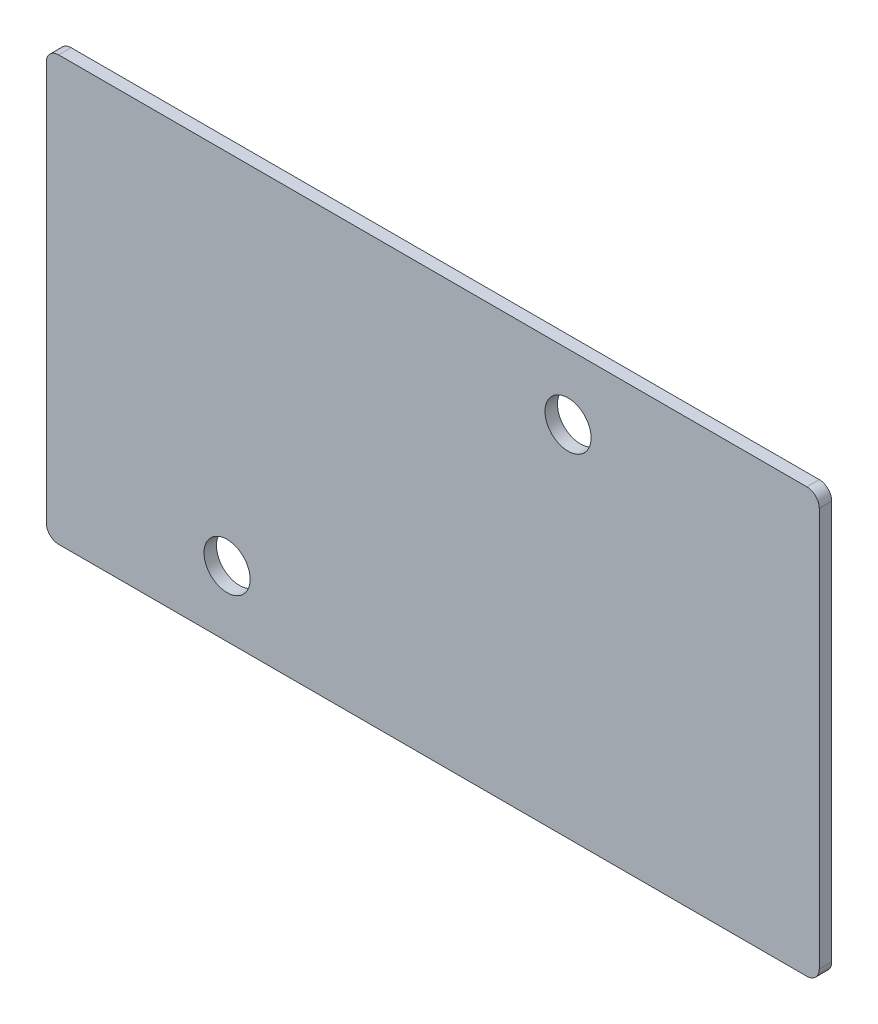
ISO-10303-21;
HEADER;
FILE_DESCRIPTION(('STEP AP214'),'2;1');
FILE_NAME('part.step','',(''),(''),'','','');
FILE_SCHEMA(('AUTOMOTIVE_DESIGN { 1 0 10303 214 1 1 1 1 }'));
ENDSEC;
DATA;
#1=APPLICATION_CONTEXT('core data for automotive mechanical design processes');
#2=APPLICATION_PROTOCOL_DEFINITION('international standard','automotive_design',2000,#1);
#3=PRODUCT_CONTEXT('',#1,'mechanical');
#4=PRODUCT('Part','Part','',(#3));
#5=PRODUCT_RELATED_PRODUCT_CATEGORY('part','',(#4));
#6=PRODUCT_DEFINITION_FORMATION('','',#4);
#7=PRODUCT_DEFINITION_CONTEXT('part definition',#1,'design');
#8=PRODUCT_DEFINITION('design','',#6,#7);
#9=PRODUCT_DEFINITION_SHAPE('','',#8);
#10=(LENGTH_UNIT() NAMED_UNIT(*) SI_UNIT(.MILLI.,.METRE.));
#11=(NAMED_UNIT(*) PLANE_ANGLE_UNIT() SI_UNIT($,.RADIAN.));
#12=(NAMED_UNIT(*) SI_UNIT($,.STERADIAN.) SOLID_ANGLE_UNIT());
#13=UNCERTAINTY_MEASURE_WITH_UNIT(LENGTH_MEASURE(1.E-05),#10,'distance_accuracy_value','');
#14=(GEOMETRIC_REPRESENTATION_CONTEXT(3) GLOBAL_UNCERTAINTY_ASSIGNED_CONTEXT((#13)) GLOBAL_UNIT_ASSIGNED_CONTEXT((#10,
#11,#12)) REPRESENTATION_CONTEXT('',''));
#15=CARTESIAN_POINT('',(0.,0.,0.));
#16=DIRECTION('',(0.,0.,1.));
#17=DIRECTION('',(1.,0.,0.));
#18=AXIS2_PLACEMENT_3D('',#15,#16,#17);
#19=CARTESIAN_POINT('',(-5.,-1.25,1.));
#20=DIRECTION('',(0.,0.,1.));
#21=DIRECTION('',(1.,0.,0.));
#22=AXIS2_PLACEMENT_3D('',#19,#20,#21);
#23=PLANE('',#22);
#24=CARTESIAN_POINT('',(35.85,26.5,1.));
#25=DIRECTION('',(0.,0.,1.));
#26=DIRECTION('',(1.,0.,0.));
#27=AXIS2_PLACEMENT_3D('',#24,#25,#26);
#28=CIRCLE('',#27,1.85);
#29=CARTESIAN_POINT('',(37.7,26.5,1.));
#30=VERTEX_POINT('',#29);
#31=EDGE_CURVE('E135',#30,#30,#28,.T.);
#32=ORIENTED_EDGE('',*,*,#31,.F.);
#33=EDGE_LOOP('',(#32));
#34=FACE_BOUND('',#33,.T.);
#35=CARTESIAN_POINT('',(-5.,-1.25,1.));
#36=DIRECTION('',(0.,0.,1.));
#37=DIRECTION('',(1.,0.,0.));
#38=AXIS2_PLACEMENT_3D('',#35,#36,#37);
#39=CIRCLE('',#38,1.);
#40=CARTESIAN_POINT('',(-6.,-1.25,1.));
#41=VERTEX_POINT('',#40);
#42=CARTESIAN_POINT('',(-5.,-2.25,1.));
#43=VERTEX_POINT('',#42);
#44=EDGE_CURVE('E146',#41,#43,#39,.T.);
#45=ORIENTED_EDGE('',*,*,#44,.T.);
#46=DIRECTION('',(1.,0.,0.));
#47=VECTOR('',#46,1.);
#48=CARTESIAN_POINT('',(-5.,-2.25,1.));
#49=LINE('',#48,#47);
#50=CARTESIAN_POINT('',(55.,-2.25,1.));
#51=VERTEX_POINT('',#50);
#52=EDGE_CURVE('E94',#43,#51,#49,.T.);
#53=ORIENTED_EDGE('',*,*,#52,.T.);
#54=CARTESIAN_POINT('',(55.,-1.25,1.));
#55=DIRECTION('',(0.,0.,1.));
#56=DIRECTION('',(1.,0.,0.));
#57=AXIS2_PLACEMENT_3D('',#54,#55,#56);
#58=CIRCLE('',#57,1.);
#59=CARTESIAN_POINT('',(56.,-1.25,1.));
#60=VERTEX_POINT('',#59);
#61=EDGE_CURVE('E161',#51,#60,#58,.T.);
#62=ORIENTED_EDGE('',*,*,#61,.T.);
#63=DIRECTION('',(0.,1.,0.));
#64=VECTOR('',#63,1.);
#65=CARTESIAN_POINT('',(56.,-1.25,1.));
#66=LINE('',#65,#64);
#67=CARTESIAN_POINT('',(56.,30.75,1.));
#68=VERTEX_POINT('',#67);
#69=EDGE_CURVE('E174',#60,#68,#66,.T.);
#70=ORIENTED_EDGE('',*,*,#69,.T.);
#71=CARTESIAN_POINT('',(55.,30.75,1.));
#72=DIRECTION('',(0.,0.,1.));
#73=DIRECTION('',(1.,0.,0.));
#74=AXIS2_PLACEMENT_3D('',#71,#72,#73);
#75=CIRCLE('',#74,1.);
#76=CARTESIAN_POINT('',(55.,31.75,1.));
#77=VERTEX_POINT('',#76);
#78=EDGE_CURVE('E113',#68,#77,#75,.T.);
#79=ORIENTED_EDGE('',*,*,#78,.T.);
#80=DIRECTION('',(-1.,0.,0.));
#81=VECTOR('',#80,1.);
#82=CARTESIAN_POINT('',(-5.,31.75,1.));
#83=LINE('',#82,#81);
#84=CARTESIAN_POINT('',(-5.,31.75,1.));
#85=VERTEX_POINT('',#84);
#86=EDGE_CURVE('E107',#77,#85,#83,.T.);
#87=ORIENTED_EDGE('',*,*,#86,.T.);
#88=CARTESIAN_POINT('',(-5.,30.75,1.));
#89=DIRECTION('',(0.,0.,1.));
#90=DIRECTION('',(1.,0.,0.));
#91=AXIS2_PLACEMENT_3D('',#88,#89,#90);
#92=CIRCLE('',#91,1.);
#93=CARTESIAN_POINT('',(-6.,30.75,1.));
#94=VERTEX_POINT('',#93);
#95=EDGE_CURVE('E111',#85,#94,#92,.T.);
#96=ORIENTED_EDGE('',*,*,#95,.T.);
#97=DIRECTION('',(0.,-1.,0.));
#98=VECTOR('',#97,1.);
#99=CARTESIAN_POINT('',(-6.,-1.25,1.));
#100=LINE('',#99,#98);
#101=EDGE_CURVE('E51',#94,#41,#100,.T.);
#102=ORIENTED_EDGE('',*,*,#101,.T.);
#103=EDGE_LOOP('',(#45,#53,#62,#70,#79,#87,#96,#102));
#104=FACE_BOUND('',#103,.T.);
#105=CARTESIAN_POINT('',(8.5,3.,1.));
#106=DIRECTION('',(0.,0.,1.));
#107=DIRECTION('',(1.,0.,0.));
#108=AXIS2_PLACEMENT_3D('',#105,#106,#107);
#109=CIRCLE('',#108,1.85);
#110=CARTESIAN_POINT('',(10.35,3.,1.));
#111=VERTEX_POINT('',#110);
#112=EDGE_CURVE('E183',#111,#111,#109,.T.);
#113=ORIENTED_EDGE('',*,*,#112,.F.);
#114=EDGE_LOOP('',(#113));
#115=FACE_BOUND('',#114,.T.);
#116=ADVANCED_FACE('F34',(#34,#104,#115),#23,.T.);
#117=CARTESIAN_POINT('',(-5.,-1.25,0.));
#118=DIRECTION('',(0.,0.,1.));
#119=DIRECTION('',(1.,0.,0.));
#120=AXIS2_PLACEMENT_3D('',#117,#118,#119);
#121=PLANE('',#120);
#122=CARTESIAN_POINT('',(35.85,26.5,0.));
#123=DIRECTION('',(0.,0.,1.));
#124=DIRECTION('',(1.,0.,0.));
#125=AXIS2_PLACEMENT_3D('',#122,#123,#124);
#126=CIRCLE('',#125,1.85);
#127=CARTESIAN_POINT('',(37.7,26.5,0.));
#128=VERTEX_POINT('',#127);
#129=EDGE_CURVE('E180',#128,#128,#126,.T.);
#130=ORIENTED_EDGE('',*,*,#129,.T.);
#131=EDGE_LOOP('',(#130));
#132=FACE_BOUND('',#131,.T.);
#133=CARTESIAN_POINT('',(-5.,-1.25,0.));
#134=DIRECTION('',(0.,0.,1.));
#135=DIRECTION('',(1.,0.,0.));
#136=AXIS2_PLACEMENT_3D('',#133,#134,#135);
#137=CIRCLE('',#136,1.);
#138=CARTESIAN_POINT('',(-6.,-1.25,0.));
#139=VERTEX_POINT('',#138);
#140=CARTESIAN_POINT('',(-5.,-2.25,0.));
#141=VERTEX_POINT('',#140);
#142=EDGE_CURVE('E131',#139,#141,#137,.T.);
#143=ORIENTED_EDGE('',*,*,#142,.F.);
#144=DIRECTION('',(0.,-1.,0.));
#145=VECTOR('',#144,1.);
#146=CARTESIAN_POINT('',(-6.,-1.25,0.));
#147=LINE('',#146,#145);
#148=CARTESIAN_POINT('',(-6.,30.75,0.));
#149=VERTEX_POINT('',#148);
#150=EDGE_CURVE('E86',#149,#139,#147,.T.);
#151=ORIENTED_EDGE('',*,*,#150,.F.);
#152=CARTESIAN_POINT('',(-5.,30.75,0.));
#153=DIRECTION('',(0.,0.,1.));
#154=DIRECTION('',(1.,0.,0.));
#155=AXIS2_PLACEMENT_3D('',#152,#153,#154);
#156=CIRCLE('',#155,1.);
#157=CARTESIAN_POINT('',(-5.,31.75,0.));
#158=VERTEX_POINT('',#157);
#159=EDGE_CURVE('E80',#158,#149,#156,.T.);
#160=ORIENTED_EDGE('',*,*,#159,.F.);
#161=DIRECTION('',(-1.,0.,0.));
#162=VECTOR('',#161,1.);
#163=CARTESIAN_POINT('',(-5.,31.75,0.));
#164=LINE('',#163,#162);
#165=CARTESIAN_POINT('',(55.,31.75,0.));
#166=VERTEX_POINT('',#165);
#167=EDGE_CURVE('E121',#166,#158,#164,.T.);
#168=ORIENTED_EDGE('',*,*,#167,.F.);
#169=CARTESIAN_POINT('',(55.,30.75,0.));
#170=DIRECTION('',(0.,0.,1.));
#171=DIRECTION('',(1.,0.,0.));
#172=AXIS2_PLACEMENT_3D('',#169,#170,#171);
#173=CIRCLE('',#172,1.);
#174=CARTESIAN_POINT('',(56.,30.75,0.));
#175=VERTEX_POINT('',#174);
#176=EDGE_CURVE('E141',#175,#166,#173,.T.);
#177=ORIENTED_EDGE('',*,*,#176,.F.);
#178=DIRECTION('',(0.,1.,0.));
#179=VECTOR('',#178,1.);
#180=CARTESIAN_POINT('',(56.,-1.25,0.));
#181=LINE('',#180,#179);
#182=CARTESIAN_POINT('',(56.,-1.25,0.));
#183=VERTEX_POINT('',#182);
#184=EDGE_CURVE('E139',#183,#175,#181,.T.);
#185=ORIENTED_EDGE('',*,*,#184,.F.);
#186=CARTESIAN_POINT('',(55.,-1.25,0.));
#187=DIRECTION('',(0.,0.,1.));
#188=DIRECTION('',(1.,0.,0.));
#189=AXIS2_PLACEMENT_3D('',#186,#187,#188);
#190=CIRCLE('',#189,1.);
#191=CARTESIAN_POINT('',(55.,-2.25,0.));
#192=VERTEX_POINT('',#191);
#193=EDGE_CURVE('E137',#192,#183,#190,.T.);
#194=ORIENTED_EDGE('',*,*,#193,.F.);
#195=DIRECTION('',(1.,0.,0.));
#196=VECTOR('',#195,1.);
#197=CARTESIAN_POINT('',(-5.,-2.25,0.));
#198=LINE('',#197,#196);
#199=EDGE_CURVE('E134',#141,#192,#198,.T.);
#200=ORIENTED_EDGE('',*,*,#199,.F.);
#201=EDGE_LOOP('',(#143,#151,#160,#168,#177,#185,#194,#200));
#202=FACE_BOUND('',#201,.T.);
#203=CARTESIAN_POINT('',(8.5,3.,0.));
#204=DIRECTION('',(0.,0.,1.));
#205=DIRECTION('',(1.,0.,0.));
#206=AXIS2_PLACEMENT_3D('',#203,#204,#205);
#207=CIRCLE('',#206,1.85);
#208=CARTESIAN_POINT('',(10.35,3.,0.));
#209=VERTEX_POINT('',#208);
#210=EDGE_CURVE('E186',#209,#209,#207,.T.);
#211=ORIENTED_EDGE('',*,*,#210,.T.);
#212=EDGE_LOOP('',(#211));
#213=FACE_BOUND('',#212,.T.);
#214=ADVANCED_FACE('F165',(#132,#202,#213),#121,.F.);
#215=CARTESIAN_POINT('',(-5.,-1.25,1.));
#216=DIRECTION('',(0.,0.,-1.));
#217=DIRECTION('',(-1.,0.,0.));
#218=AXIS2_PLACEMENT_3D('',#215,#216,#217);
#219=CYLINDRICAL_SURFACE('',#218,1.);
#220=ORIENTED_EDGE('',*,*,#142,.T.);
#221=DIRECTION('',(0.,0.,-1.));
#222=VECTOR('',#221,1.);
#223=CARTESIAN_POINT('',(-5.,-2.25,1.));
#224=LINE('',#223,#222);
#225=EDGE_CURVE('E11',#43,#141,#224,.T.);
#226=ORIENTED_EDGE('',*,*,#225,.F.);
#227=ORIENTED_EDGE('',*,*,#44,.F.);
#228=DIRECTION('',(0.,0.,-1.));
#229=VECTOR('',#228,1.);
#230=CARTESIAN_POINT('',(-6.,-1.25,1.));
#231=LINE('',#230,#229);
#232=EDGE_CURVE('E127',#41,#139,#231,.T.);
#233=ORIENTED_EDGE('',*,*,#232,.T.);
#234=EDGE_LOOP('',(#220,#226,#227,#233));
#235=FACE_BOUND('',#234,.T.);
#236=ADVANCED_FACE('F36',(#235),#219,.T.);
#237=CARTESIAN_POINT('',(-5.,-2.25,1.));
#238=DIRECTION('',(0.,1.,0.));
#239=DIRECTION('',(-1.,0.,0.));
#240=AXIS2_PLACEMENT_3D('',#237,#238,#239);
#241=PLANE('',#240);
#242=ORIENTED_EDGE('',*,*,#199,.T.);
#243=DIRECTION('',(0.,0.,-1.));
#244=VECTOR('',#243,1.);
#245=CARTESIAN_POINT('',(55.,-2.25,1.));
#246=LINE('',#245,#244);
#247=EDGE_CURVE('E43',#51,#192,#246,.T.);
#248=ORIENTED_EDGE('',*,*,#247,.F.);
#249=ORIENTED_EDGE('',*,*,#52,.F.);
#250=ORIENTED_EDGE('',*,*,#225,.T.);
#251=EDGE_LOOP('',(#242,#248,#249,#250));
#252=FACE_BOUND('',#251,.T.);
#253=ADVANCED_FACE('F219',(#252),#241,.F.);
#254=CARTESIAN_POINT('',(55.,-1.25,1.));
#255=DIRECTION('',(0.,0.,-1.));
#256=DIRECTION('',(-1.,0.,0.));
#257=AXIS2_PLACEMENT_3D('',#254,#255,#256);
#258=CYLINDRICAL_SURFACE('',#257,1.);
#259=ORIENTED_EDGE('',*,*,#193,.T.);
#260=DIRECTION('',(0.,0.,-1.));
#261=VECTOR('',#260,1.);
#262=CARTESIAN_POINT('',(56.,-1.25,1.));
#263=LINE('',#262,#261);
#264=EDGE_CURVE('E153',#60,#183,#263,.T.);
#265=ORIENTED_EDGE('',*,*,#264,.F.);
#266=ORIENTED_EDGE('',*,*,#61,.F.);
#267=ORIENTED_EDGE('',*,*,#247,.T.);
#268=EDGE_LOOP('',(#259,#265,#266,#267));
#269=FACE_BOUND('',#268,.T.);
#270=ADVANCED_FACE('F159',(#269),#258,.T.);
#271=CARTESIAN_POINT('',(56.,-1.25,1.));
#272=DIRECTION('',(-1.,0.,0.));
#273=DIRECTION('',(0.,0.,1.));
#274=AXIS2_PLACEMENT_3D('',#271,#272,#273);
#275=PLANE('',#274);
#276=ORIENTED_EDGE('',*,*,#184,.T.);
#277=DIRECTION('',(0.,0.,-1.));
#278=VECTOR('',#277,1.);
#279=CARTESIAN_POINT('',(56.,30.75,1.));
#280=LINE('',#279,#278);
#281=EDGE_CURVE('E150',#68,#175,#280,.T.);
#282=ORIENTED_EDGE('',*,*,#281,.F.);
#283=ORIENTED_EDGE('',*,*,#69,.F.);
#284=ORIENTED_EDGE('',*,*,#264,.T.);
#285=EDGE_LOOP('',(#276,#282,#283,#284));
#286=FACE_BOUND('',#285,.T.);
#287=ADVANCED_FACE('F170',(#286),#275,.F.);
#288=CARTESIAN_POINT('',(55.,30.75,1.));
#289=DIRECTION('',(0.,0.,-1.));
#290=DIRECTION('',(-1.,0.,0.));
#291=AXIS2_PLACEMENT_3D('',#288,#289,#290);
#292=CYLINDRICAL_SURFACE('',#291,1.);
#293=ORIENTED_EDGE('',*,*,#176,.T.);
#294=DIRECTION('',(0.,0.,-1.));
#295=VECTOR('',#294,1.);
#296=CARTESIAN_POINT('',(55.,31.75,1.));
#297=LINE('',#296,#295);
#298=EDGE_CURVE('E122',#77,#166,#297,.T.);
#299=ORIENTED_EDGE('',*,*,#298,.F.);
#300=ORIENTED_EDGE('',*,*,#78,.F.);
#301=ORIENTED_EDGE('',*,*,#281,.T.);
#302=EDGE_LOOP('',(#293,#299,#300,#301));
#303=FACE_BOUND('',#302,.T.);
#304=ADVANCED_FACE('F173',(#303),#292,.T.);
#305=CARTESIAN_POINT('',(-5.,31.75,1.));
#306=DIRECTION('',(0.,-1.,0.));
#307=DIRECTION('',(0.,0.,-1.));
#308=AXIS2_PLACEMENT_3D('',#305,#306,#307);
#309=PLANE('',#308);
#310=ORIENTED_EDGE('',*,*,#167,.T.);
#311=DIRECTION('',(0.,0.,-1.));
#312=VECTOR('',#311,1.);
#313=CARTESIAN_POINT('',(-5.,31.75,1.));
#314=LINE('',#313,#312);
#315=EDGE_CURVE('E118',#85,#158,#314,.T.);
#316=ORIENTED_EDGE('',*,*,#315,.F.);
#317=ORIENTED_EDGE('',*,*,#86,.F.);
#318=ORIENTED_EDGE('',*,*,#298,.T.);
#319=EDGE_LOOP('',(#310,#316,#317,#318));
#320=FACE_BOUND('',#319,.T.);
#321=ADVANCED_FACE('F119',(#320),#309,.F.);
#322=CARTESIAN_POINT('',(-5.,30.75,1.));
#323=DIRECTION('',(0.,0.,-1.));
#324=DIRECTION('',(-1.,0.,0.));
#325=AXIS2_PLACEMENT_3D('',#322,#323,#324);
#326=CYLINDRICAL_SURFACE('',#325,1.);
#327=ORIENTED_EDGE('',*,*,#159,.T.);
#328=DIRECTION('',(0.,0.,-1.));
#329=VECTOR('',#328,1.);
#330=CARTESIAN_POINT('',(-6.,30.75,1.));
#331=LINE('',#330,#329);
#332=EDGE_CURVE('E123',#94,#149,#331,.T.);
#333=ORIENTED_EDGE('',*,*,#332,.F.);
#334=ORIENTED_EDGE('',*,*,#95,.F.);
#335=ORIENTED_EDGE('',*,*,#315,.T.);
#336=EDGE_LOOP('',(#327,#333,#334,#335));
#337=FACE_BOUND('',#336,.T.);
#338=ADVANCED_FACE('F125',(#337),#326,.T.);
#339=CARTESIAN_POINT('',(-6.,-1.25,1.));
#340=DIRECTION('',(1.,0.,0.));
#341=DIRECTION('',(0.,0.,-1.));
#342=AXIS2_PLACEMENT_3D('',#339,#340,#341);
#343=PLANE('',#342);
#344=ORIENTED_EDGE('',*,*,#150,.T.);
#345=ORIENTED_EDGE('',*,*,#232,.F.);
#346=ORIENTED_EDGE('',*,*,#101,.F.);
#347=ORIENTED_EDGE('',*,*,#332,.T.);
#348=EDGE_LOOP('',(#344,#345,#346,#347));
#349=FACE_BOUND('',#348,.T.);
#350=ADVANCED_FACE('F207',(#349),#343,.F.);
#351=CARTESIAN_POINT('',(35.85,26.5,1.));
#352=DIRECTION('',(0.,0.,-1.));
#353=DIRECTION('',(-1.,0.,0.));
#354=AXIS2_PLACEMENT_3D('',#351,#352,#353);
#355=CYLINDRICAL_SURFACE('',#354,1.85);
#356=ORIENTED_EDGE('',*,*,#31,.T.);
#357=EDGE_LOOP('',(#356));
#358=FACE_BOUND('',#357,.T.);
#359=ORIENTED_EDGE('',*,*,#129,.F.);
#360=EDGE_LOOP('',(#359));
#361=FACE_BOUND('',#360,.T.);
#362=ADVANCED_FACE('F204',(#358,#361),#355,.F.);
#363=CARTESIAN_POINT('',(8.5,3.,1.));
#364=DIRECTION('',(0.,0.,-1.));
#365=DIRECTION('',(-1.,0.,0.));
#366=AXIS2_PLACEMENT_3D('',#363,#364,#365);
#367=CYLINDRICAL_SURFACE('',#366,1.85);
#368=ORIENTED_EDGE('',*,*,#112,.T.);
#369=EDGE_LOOP('',(#368));
#370=FACE_BOUND('',#369,.T.);
#371=ORIENTED_EDGE('',*,*,#210,.F.);
#372=EDGE_LOOP('',(#371));
#373=FACE_BOUND('',#372,.T.);
#374=ADVANCED_FACE('F192',(#370,#373),#367,.F.);
#375=CLOSED_SHELL('',(#116,#214,#236,#253,#270,#287,#304,#321,#338,#350,#362,#374));
#376=MANIFOLD_SOLID_BREP('B2',#375);
#377=ADVANCED_BREP_SHAPE_REPRESENTATION('',(#18,#376),#14);
#378=SHAPE_DEFINITION_REPRESENTATION(#9,#377);
ENDSEC;
END-ISO-10303-21;
